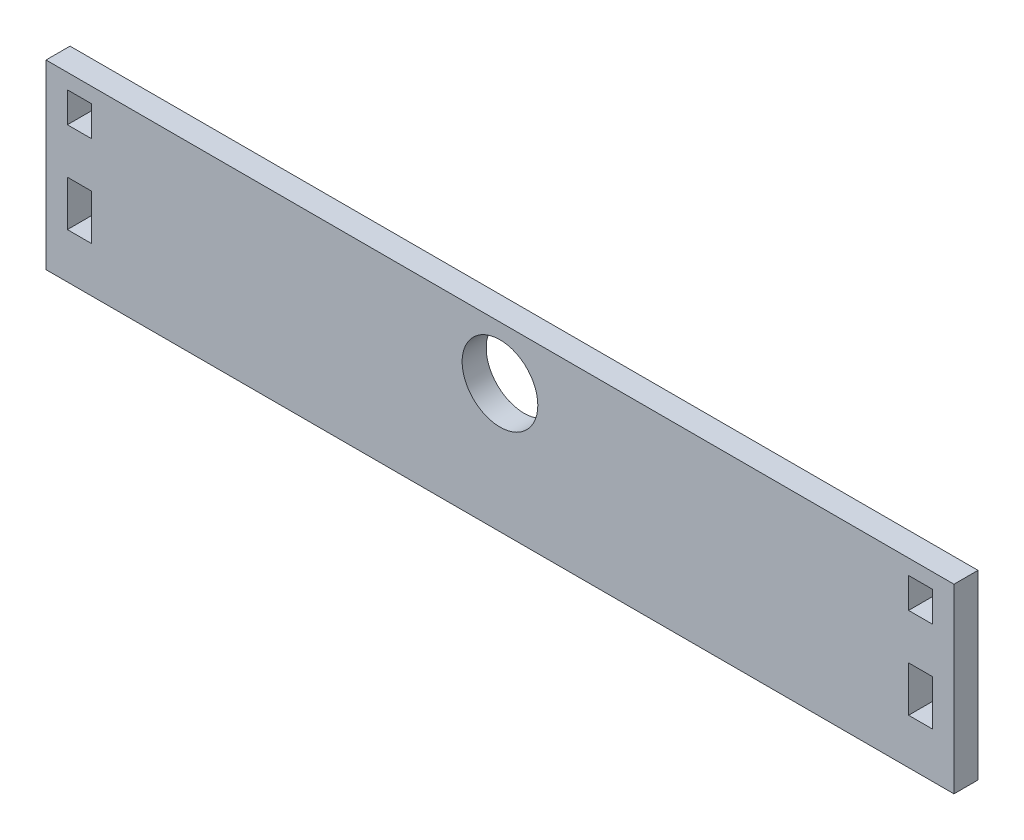
ISO-10303-21;
HEADER;
FILE_DESCRIPTION(('STEP AP214'),'2;1');
FILE_NAME('part.step','',(''),(''),'','','');
FILE_SCHEMA(('AUTOMOTIVE_DESIGN { 1 0 10303 214 1 1 1 1 }'));
ENDSEC;
DATA;
#1=APPLICATION_CONTEXT('core data for automotive mechanical design processes');
#2=APPLICATION_PROTOCOL_DEFINITION('international standard','automotive_design',2000,#1);
#3=PRODUCT_CONTEXT('',#1,'mechanical');
#4=PRODUCT('Part','Part','',(#3));
#5=PRODUCT_RELATED_PRODUCT_CATEGORY('part','',(#4));
#6=PRODUCT_DEFINITION_FORMATION('','',#4);
#7=PRODUCT_DEFINITION_CONTEXT('part definition',#1,'design');
#8=PRODUCT_DEFINITION('design','',#6,#7);
#9=PRODUCT_DEFINITION_SHAPE('','',#8);
#10=(LENGTH_UNIT() NAMED_UNIT(*) SI_UNIT(.MILLI.,.METRE.));
#11=(NAMED_UNIT(*) PLANE_ANGLE_UNIT() SI_UNIT($,.RADIAN.));
#12=(NAMED_UNIT(*) SI_UNIT($,.STERADIAN.) SOLID_ANGLE_UNIT());
#13=UNCERTAINTY_MEASURE_WITH_UNIT(LENGTH_MEASURE(1.E-05),#10,'distance_accuracy_value','');
#14=(GEOMETRIC_REPRESENTATION_CONTEXT(3) GLOBAL_UNCERTAINTY_ASSIGNED_CONTEXT((#13)) GLOBAL_UNIT_ASSIGNED_CONTEXT((#10,
#11,#12)) REPRESENTATION_CONTEXT('',''));
#15=CARTESIAN_POINT('',(0.,0.,0.));
#16=DIRECTION('',(0.,0.,1.));
#17=DIRECTION('',(1.,0.,0.));
#18=AXIS2_PLACEMENT_3D('',#15,#16,#17);
#19=CARTESIAN_POINT('',(0.,2.00000000000002,1.5875));
#20=DIRECTION('',(0.,-1.,0.));
#21=DIRECTION('',(1.,0.,0.));
#22=AXIS2_PLACEMENT_3D('',#19,#20,#21);
#23=PLANE('',#22);
#24=DIRECTION('',(-1.,0.,0.));
#25=VECTOR('',#24,1.);
#26=CARTESIAN_POINT('',(0.,2.00000000000002,0.));
#27=LINE('',#26,#25);
#28=CARTESIAN_POINT('',(55.5875,1.99999999999999,0.));
#29=VERTEX_POINT('',#28);
#30=CARTESIAN_POINT('',(54.,2.,0.));
#31=VERTEX_POINT('',#30);
#32=EDGE_CURVE('E252',#29,#31,#27,.T.);
#33=ORIENTED_EDGE('',*,*,#32,.T.);
#34=DIRECTION('',(0.,0.,-1.));
#35=VECTOR('',#34,1.);
#36=CARTESIAN_POINT('',(54.,2.,1.5875));
#37=LINE('',#36,#35);
#38=CARTESIAN_POINT('',(54.,2.,1.5875));
#39=VERTEX_POINT('',#38);
#40=EDGE_CURVE('E11',#39,#31,#37,.T.);
#41=ORIENTED_EDGE('',*,*,#40,.F.);
#42=DIRECTION('',(-1.,0.,0.));
#43=VECTOR('',#42,1.);
#44=CARTESIAN_POINT('',(0.,2.00000000000002,1.5875));
#45=LINE('',#44,#43);
#46=CARTESIAN_POINT('',(55.5875,1.99999999999999,1.5875));
#47=VERTEX_POINT('',#46);
#48=EDGE_CURVE('E192',#47,#39,#45,.T.);
#49=ORIENTED_EDGE('',*,*,#48,.F.);
#50=DIRECTION('',(0.,0.,-1.));
#51=VECTOR('',#50,1.);
#52=CARTESIAN_POINT('',(55.5875,1.99999999999999,1.5875));
#53=LINE('',#52,#51);
#54=EDGE_CURVE('E259',#47,#29,#53,.T.);
#55=ORIENTED_EDGE('',*,*,#54,.T.);
#56=EDGE_LOOP('',(#33,#41,#49,#55));
#57=FACE_BOUND('',#56,.T.);
#58=ADVANCED_FACE('F39',(#57),#23,.F.);
#59=CARTESIAN_POINT('',(54.,0.,1.5875));
#60=DIRECTION('',(-1.,0.,0.));
#61=DIRECTION('',(0.,0.,1.));
#62=AXIS2_PLACEMENT_3D('',#59,#60,#61);
#63=PLANE('',#62);
#64=DIRECTION('',(0.,1.,0.));
#65=VECTOR('',#64,1.);
#66=CARTESIAN_POINT('',(54.,0.,0.));
#67=LINE('',#66,#65);
#68=CARTESIAN_POINT('',(54.,5.,0.));
#69=VERTEX_POINT('',#68);
#70=EDGE_CURVE('E197',#31,#69,#67,.T.);
#71=ORIENTED_EDGE('',*,*,#70,.T.);
#72=DIRECTION('',(0.,0.,-1.));
#73=VECTOR('',#72,1.);
#74=CARTESIAN_POINT('',(54.,5.,1.5875));
#75=LINE('',#74,#73);
#76=CARTESIAN_POINT('',(54.,5.,1.5875));
#77=VERTEX_POINT('',#76);
#78=EDGE_CURVE('E49',#77,#69,#75,.T.);
#79=ORIENTED_EDGE('',*,*,#78,.F.);
#80=DIRECTION('',(0.,1.,0.));
#81=VECTOR('',#80,1.);
#82=CARTESIAN_POINT('',(54.,0.,1.5875));
#83=LINE('',#82,#81);
#84=EDGE_CURVE('E186',#39,#77,#83,.T.);
#85=ORIENTED_EDGE('',*,*,#84,.F.);
#86=ORIENTED_EDGE('',*,*,#40,.T.);
#87=EDGE_LOOP('',(#71,#79,#85,#86));
#88=FACE_BOUND('',#87,.T.);
#89=ADVANCED_FACE('F196',(#88),#63,.F.);
#90=CARTESIAN_POINT('',(0.,5.00000000000002,1.5875));
#91=DIRECTION('',(0.,1.,0.));
#92=DIRECTION('',(-1.,0.,0.));
#93=AXIS2_PLACEMENT_3D('',#90,#91,#92);
#94=PLANE('',#93);
#95=DIRECTION('',(1.,0.,0.));
#96=VECTOR('',#95,1.);
#97=CARTESIAN_POINT('',(0.,5.00000000000002,0.));
#98=LINE('',#97,#96);
#99=CARTESIAN_POINT('',(55.5875,4.99999999999999,0.));
#100=VERTEX_POINT('',#99);
#101=EDGE_CURVE('E123',#69,#100,#98,.T.);
#102=ORIENTED_EDGE('',*,*,#101,.T.);
#103=DIRECTION('',(0.,0.,-1.));
#104=VECTOR('',#103,1.);
#105=CARTESIAN_POINT('',(55.5875,4.99999999999999,1.5875));
#106=LINE('',#105,#104);
#107=CARTESIAN_POINT('',(55.5875,4.99999999999999,1.5875));
#108=VERTEX_POINT('',#107);
#109=EDGE_CURVE('E198',#108,#100,#106,.T.);
#110=ORIENTED_EDGE('',*,*,#109,.F.);
#111=DIRECTION('',(1.,0.,0.));
#112=VECTOR('',#111,1.);
#113=CARTESIAN_POINT('',(0.,5.00000000000002,1.5875));
#114=LINE('',#113,#112);
#115=EDGE_CURVE('E190',#77,#108,#114,.T.);
#116=ORIENTED_EDGE('',*,*,#115,.F.);
#117=ORIENTED_EDGE('',*,*,#78,.T.);
#118=EDGE_LOOP('',(#102,#110,#116,#117));
#119=FACE_BOUND('',#118,.T.);
#120=ADVANCED_FACE('F200',(#119),#94,.F.);
#121=CARTESIAN_POINT('',(0.,8.00000000000012,1.5875));
#122=DIRECTION('',(0.,-1.,0.));
#123=DIRECTION('',(1.,0.,0.));
#124=AXIS2_PLACEMENT_3D('',#121,#122,#123);
#125=PLANE('',#124);
#126=DIRECTION('',(-1.,0.,0.));
#127=VECTOR('',#126,1.);
#128=CARTESIAN_POINT('',(0.,8.00000000000012,0.));
#129=LINE('',#128,#127);
#130=CARTESIAN_POINT('',(55.5875,8.,0.));
#131=VERTEX_POINT('',#130);
#132=CARTESIAN_POINT('',(54.,8.,0.));
#133=VERTEX_POINT('',#132);
#134=EDGE_CURVE('E243',#131,#133,#129,.T.);
#135=ORIENTED_EDGE('',*,*,#134,.T.);
#136=DIRECTION('',(0.,0.,-1.));
#137=VECTOR('',#136,1.);
#138=CARTESIAN_POINT('',(54.,8.,1.5875));
#139=LINE('',#138,#137);
#140=CARTESIAN_POINT('',(54.,8.,1.5875));
#141=VERTEX_POINT('',#140);
#142=EDGE_CURVE('E261',#141,#133,#139,.T.);
#143=ORIENTED_EDGE('',*,*,#142,.F.);
#144=DIRECTION('',(-1.,0.,0.));
#145=VECTOR('',#144,1.);
#146=CARTESIAN_POINT('',(0.,8.00000000000012,1.5875));
#147=LINE('',#146,#145);
#148=CARTESIAN_POINT('',(55.5875,8.,1.5875));
#149=VERTEX_POINT('',#148);
#150=EDGE_CURVE('E344',#149,#141,#147,.T.);
#151=ORIENTED_EDGE('',*,*,#150,.F.);
#152=DIRECTION('',(0.,0.,-1.));
#153=VECTOR('',#152,1.);
#154=CARTESIAN_POINT('',(55.5875,8.,1.5875));
#155=LINE('',#154,#153);
#156=EDGE_CURVE('E263',#149,#131,#155,.T.);
#157=ORIENTED_EDGE('',*,*,#156,.T.);
#158=EDGE_LOOP('',(#135,#143,#151,#157));
#159=FACE_BOUND('',#158,.T.);
#160=ADVANCED_FACE('F364',(#159),#125,.F.);
#161=CARTESIAN_POINT('',(54.,0.,1.5875));
#162=DIRECTION('',(-1.,0.,0.));
#163=DIRECTION('',(0.,0.,1.));
#164=AXIS2_PLACEMENT_3D('',#161,#162,#163);
#165=PLANE('',#164);
#166=DIRECTION('',(0.,1.,0.));
#167=VECTOR('',#166,1.);
#168=CARTESIAN_POINT('',(54.,0.,0.));
#169=LINE('',#168,#167);
#170=CARTESIAN_POINT('',(54.,10.,0.));
#171=VERTEX_POINT('',#170);
#172=EDGE_CURVE('E246',#133,#171,#169,.T.);
#173=ORIENTED_EDGE('',*,*,#172,.T.);
#174=DIRECTION('',(0.,0.,-1.));
#175=VECTOR('',#174,1.);
#176=CARTESIAN_POINT('',(54.,10.,1.5875));
#177=LINE('',#176,#175);
#178=CARTESIAN_POINT('',(54.,10.,1.5875));
#179=VERTEX_POINT('',#178);
#180=EDGE_CURVE('E270',#179,#171,#177,.T.);
#181=ORIENTED_EDGE('',*,*,#180,.F.);
#182=DIRECTION('',(0.,1.,0.));
#183=VECTOR('',#182,1.);
#184=CARTESIAN_POINT('',(54.,0.,1.5875));
#185=LINE('',#184,#183);
#186=EDGE_CURVE('E347',#141,#179,#185,.T.);
#187=ORIENTED_EDGE('',*,*,#186,.F.);
#188=ORIENTED_EDGE('',*,*,#142,.T.);
#189=EDGE_LOOP('',(#173,#181,#187,#188));
#190=FACE_BOUND('',#189,.T.);
#191=ADVANCED_FACE('F366',(#190),#165,.F.);
#192=CARTESIAN_POINT('',(0.,10.0000000000002,1.5875));
#193=DIRECTION('',(0.,1.,0.));
#194=DIRECTION('',(-1.,0.,0.));
#195=AXIS2_PLACEMENT_3D('',#192,#193,#194);
#196=PLANE('',#195);
#197=DIRECTION('',(1.,0.,0.));
#198=VECTOR('',#197,1.);
#199=CARTESIAN_POINT('',(0.,10.0000000000002,0.));
#200=LINE('',#199,#198);
#201=CARTESIAN_POINT('',(55.5875,9.99999999999999,0.));
#202=VERTEX_POINT('',#201);
#203=EDGE_CURVE('E248',#171,#202,#200,.T.);
#204=ORIENTED_EDGE('',*,*,#203,.T.);
#205=DIRECTION('',(0.,0.,-1.));
#206=VECTOR('',#205,1.);
#207=CARTESIAN_POINT('',(55.5875,9.99999999999999,1.5875));
#208=LINE('',#207,#206);
#209=CARTESIAN_POINT('',(55.5875,9.99999999999999,1.5875));
#210=VERTEX_POINT('',#209);
#211=EDGE_CURVE('E266',#210,#202,#208,.T.);
#212=ORIENTED_EDGE('',*,*,#211,.F.);
#213=DIRECTION('',(1.,0.,0.));
#214=VECTOR('',#213,1.);
#215=CARTESIAN_POINT('',(0.,10.0000000000002,1.5875));
#216=LINE('',#215,#214);
#217=EDGE_CURVE('E349',#179,#210,#216,.T.);
#218=ORIENTED_EDGE('',*,*,#217,.F.);
#219=ORIENTED_EDGE('',*,*,#180,.T.);
#220=EDGE_LOOP('',(#204,#212,#218,#219));
#221=FACE_BOUND('',#220,.T.);
#222=ADVANCED_FACE('F370',(#221),#196,.F.);
#223=CARTESIAN_POINT('',(57.,0.,1.5875));
#224=DIRECTION('',(1.,0.,0.));
#225=DIRECTION('',(0.,0.,-1.));
#226=AXIS2_PLACEMENT_3D('',#223,#224,#225);
#227=PLANE('',#226);
#228=DIRECTION('',(0.,-1.,0.));
#229=VECTOR('',#228,1.);
#230=CARTESIAN_POINT('',(57.,0.,0.));
#231=LINE('',#230,#229);
#232=CARTESIAN_POINT('',(57.,11.,0.));
#233=VERTEX_POINT('',#232);
#234=CARTESIAN_POINT('',(57.,-1.00000000000001,0.));
#235=VERTEX_POINT('',#234);
#236=EDGE_CURVE('E231',#233,#235,#231,.T.);
#237=ORIENTED_EDGE('',*,*,#236,.F.);
#238=DIRECTION('',(0.,0.,-1.));
#239=VECTOR('',#238,1.);
#240=CARTESIAN_POINT('',(57.,11.,1.5875));
#241=LINE('',#240,#239);
#242=CARTESIAN_POINT('',(57.,11.,1.5875));
#243=VERTEX_POINT('',#242);
#244=EDGE_CURVE('E267',#243,#233,#241,.T.);
#245=ORIENTED_EDGE('',*,*,#244,.F.);
#246=DIRECTION('',(0.,-1.,0.));
#247=VECTOR('',#246,1.);
#248=CARTESIAN_POINT('',(57.,0.,1.5875));
#249=LINE('',#248,#247);
#250=CARTESIAN_POINT('',(57.,-1.00000000000001,1.5875));
#251=VERTEX_POINT('',#250);
#252=EDGE_CURVE('E332',#243,#251,#249,.T.);
#253=ORIENTED_EDGE('',*,*,#252,.T.);
#254=DIRECTION('',(0.,0.,-1.));
#255=VECTOR('',#254,1.);
#256=CARTESIAN_POINT('',(57.,-1.00000000000001,1.5875));
#257=LINE('',#256,#255);
#258=EDGE_CURVE('E275',#251,#235,#257,.T.);
#259=ORIENTED_EDGE('',*,*,#258,.T.);
#260=EDGE_LOOP('',(#237,#245,#253,#259));
#261=FACE_BOUND('',#260,.T.);
#262=ADVANCED_FACE('F403',(#261),#227,.T.);
#263=CARTESIAN_POINT('',(0.,11.,1.5875));
#264=DIRECTION('',(0.,1.,0.));
#265=DIRECTION('',(0.,0.,1.));
#266=AXIS2_PLACEMENT_3D('',#263,#264,#265);
#267=PLANE('',#266);
#268=DIRECTION('',(1.,0.,0.));
#269=VECTOR('',#268,1.);
#270=CARTESIAN_POINT('',(0.,11.,0.));
#271=LINE('',#270,#269);
#272=CARTESIAN_POINT('',(-3.,11.,0.));
#273=VERTEX_POINT('',#272);
#274=EDGE_CURVE('E234',#273,#233,#271,.T.);
#275=ORIENTED_EDGE('',*,*,#274,.F.);
#276=DIRECTION('',(0.,0.,-1.));
#277=VECTOR('',#276,1.);
#278=CARTESIAN_POINT('',(-3.,11.,1.5875));
#279=LINE('',#278,#277);
#280=CARTESIAN_POINT('',(-3.,11.,1.5875));
#281=VERTEX_POINT('',#280);
#282=EDGE_CURVE('E280',#281,#273,#279,.T.);
#283=ORIENTED_EDGE('',*,*,#282,.F.);
#284=DIRECTION('',(1.,0.,0.));
#285=VECTOR('',#284,1.);
#286=CARTESIAN_POINT('',(0.,11.,1.5875));
#287=LINE('',#286,#285);
#288=EDGE_CURVE('E335',#281,#243,#287,.T.);
#289=ORIENTED_EDGE('',*,*,#288,.T.);
#290=ORIENTED_EDGE('',*,*,#244,.T.);
#291=EDGE_LOOP('',(#275,#283,#289,#290));
#292=FACE_BOUND('',#291,.T.);
#293=ADVANCED_FACE('F415',(#292),#267,.T.);
#294=CARTESIAN_POINT('',(-3.,0.,1.5875));
#295=DIRECTION('',(-1.,0.,0.));
#296=DIRECTION('',(0.,0.,1.));
#297=AXIS2_PLACEMENT_3D('',#294,#295,#296);
#298=PLANE('',#297);
#299=DIRECTION('',(0.,1.,0.));
#300=VECTOR('',#299,1.);
#301=CARTESIAN_POINT('',(-3.,0.,0.));
#302=LINE('',#301,#300);
#303=CARTESIAN_POINT('',(-3.,-1.00000000000001,0.));
#304=VERTEX_POINT('',#303);
#305=EDGE_CURVE('E237',#304,#273,#302,.T.);
#306=ORIENTED_EDGE('',*,*,#305,.F.);
#307=DIRECTION('',(0.,0.,-1.));
#308=VECTOR('',#307,1.);
#309=CARTESIAN_POINT('',(-3.,-1.00000000000001,1.5875));
#310=LINE('',#309,#308);
#311=CARTESIAN_POINT('',(-3.,-1.00000000000001,1.5875));
#312=VERTEX_POINT('',#311);
#313=EDGE_CURVE('E277',#312,#304,#310,.T.);
#314=ORIENTED_EDGE('',*,*,#313,.F.);
#315=DIRECTION('',(0.,1.,0.));
#316=VECTOR('',#315,1.);
#317=CARTESIAN_POINT('',(-3.,0.,1.5875));
#318=LINE('',#317,#316);
#319=EDGE_CURVE('E338',#312,#281,#318,.T.);
#320=ORIENTED_EDGE('',*,*,#319,.T.);
#321=ORIENTED_EDGE('',*,*,#282,.T.);
#322=EDGE_LOOP('',(#306,#314,#320,#321));
#323=FACE_BOUND('',#322,.T.);
#324=ADVANCED_FACE('F411',(#323),#298,.T.);
#325=CARTESIAN_POINT('',(0.,0.,1.5875));
#326=DIRECTION('',(-1.,0.,0.));
#327=DIRECTION('',(0.,0.,1.));
#328=AXIS2_PLACEMENT_3D('',#325,#326,#327);
#329=PLANE('',#328);
#330=DIRECTION('',(0.,1.,0.));
#331=VECTOR('',#330,1.);
#332=CARTESIAN_POINT('',(0.,0.,0.));
#333=LINE('',#332,#331);
#334=CARTESIAN_POINT('',(0.,8.,0.));
#335=VERTEX_POINT('',#334);
#336=CARTESIAN_POINT('',(0.,10.,0.));
#337=VERTEX_POINT('',#336);
#338=EDGE_CURVE('E219',#335,#337,#333,.T.);
#339=ORIENTED_EDGE('',*,*,#338,.F.);
#340=DIRECTION('',(0.,0.,-1.));
#341=VECTOR('',#340,1.);
#342=CARTESIAN_POINT('',(0.,8.,1.5875));
#343=LINE('',#342,#341);
#344=CARTESIAN_POINT('',(0.,8.,1.5875));
#345=VERTEX_POINT('',#344);
#346=EDGE_CURVE('E278',#345,#335,#343,.T.);
#347=ORIENTED_EDGE('',*,*,#346,.F.);
#348=DIRECTION('',(0.,1.,0.));
#349=VECTOR('',#348,1.);
#350=CARTESIAN_POINT('',(0.,0.,1.5875));
#351=LINE('',#350,#349);
#352=CARTESIAN_POINT('',(0.,10.,1.5875));
#353=VERTEX_POINT('',#352);
#354=EDGE_CURVE('E317',#345,#353,#351,.T.);
#355=ORIENTED_EDGE('',*,*,#354,.T.);
#356=DIRECTION('',(0.,0.,-1.));
#357=VECTOR('',#356,1.);
#358=CARTESIAN_POINT('',(0.,10.,1.5875));
#359=LINE('',#358,#357);
#360=EDGE_CURVE('E283',#353,#337,#359,.T.);
#361=ORIENTED_EDGE('',*,*,#360,.T.);
#362=EDGE_LOOP('',(#339,#347,#355,#361));
#363=FACE_BOUND('',#362,.T.);
#364=ADVANCED_FACE('F414',(#363),#329,.T.);
#365=CARTESIAN_POINT('',(0.,8.,1.5875));
#366=DIRECTION('',(0.,1.,0.));
#367=DIRECTION('',(-1.,0.,0.));
#368=AXIS2_PLACEMENT_3D('',#365,#366,#367);
#369=PLANE('',#368);
#370=DIRECTION('',(1.,0.,0.));
#371=VECTOR('',#370,1.);
#372=CARTESIAN_POINT('',(0.,8.,0.));
#373=LINE('',#372,#371);
#374=CARTESIAN_POINT('',(-1.5875,8.,0.));
#375=VERTEX_POINT('',#374);
#376=EDGE_CURVE('E222',#375,#335,#373,.T.);
#377=ORIENTED_EDGE('',*,*,#376,.F.);
#378=DIRECTION('',(0.,0.,-1.));
#379=VECTOR('',#378,1.);
#380=CARTESIAN_POINT('',(-1.5875,8.,1.5875));
#381=LINE('',#380,#379);
#382=CARTESIAN_POINT('',(-1.5875,8.,1.5875));
#383=VERTEX_POINT('',#382);
#384=EDGE_CURVE('E287',#383,#375,#381,.T.);
#385=ORIENTED_EDGE('',*,*,#384,.F.);
#386=DIRECTION('',(1.,0.,0.));
#387=VECTOR('',#386,1.);
#388=CARTESIAN_POINT('',(0.,8.,1.5875));
#389=LINE('',#388,#387);
#390=EDGE_CURVE('E320',#383,#345,#389,.T.);
#391=ORIENTED_EDGE('',*,*,#390,.T.);
#392=ORIENTED_EDGE('',*,*,#346,.T.);
#393=EDGE_LOOP('',(#377,#385,#391,#392));
#394=FACE_BOUND('',#393,.T.);
#395=ADVANCED_FACE('F429',(#394),#369,.T.);
#396=CARTESIAN_POINT('',(-1.5875,0.,1.5875));
#397=DIRECTION('',(1.,0.,0.));
#398=DIRECTION('',(0.,1.,0.));
#399=AXIS2_PLACEMENT_3D('',#396,#397,#398);
#400=PLANE('',#399);
#401=DIRECTION('',(0.,-1.,0.));
#402=VECTOR('',#401,1.);
#403=CARTESIAN_POINT('',(-1.5875,0.,0.));
#404=LINE('',#403,#402);
#405=CARTESIAN_POINT('',(-1.5875,9.99999999999999,0.));
#406=VERTEX_POINT('',#405);
#407=EDGE_CURVE('E225',#406,#375,#404,.T.);
#408=ORIENTED_EDGE('',*,*,#407,.F.);
#409=DIRECTION('',(0.,0.,-1.));
#410=VECTOR('',#409,1.);
#411=CARTESIAN_POINT('',(-1.5875,9.99999999999999,1.5875));
#412=LINE('',#411,#410);
#413=CARTESIAN_POINT('',(-1.5875,9.99999999999999,1.5875));
#414=VERTEX_POINT('',#413);
#415=EDGE_CURVE('E285',#414,#406,#412,.T.);
#416=ORIENTED_EDGE('',*,*,#415,.F.);
#417=DIRECTION('',(0.,-1.,0.));
#418=VECTOR('',#417,1.);
#419=CARTESIAN_POINT('',(-1.5875,0.,1.5875));
#420=LINE('',#419,#418);
#421=EDGE_CURVE('E326',#414,#383,#420,.T.);
#422=ORIENTED_EDGE('',*,*,#421,.T.);
#423=ORIENTED_EDGE('',*,*,#384,.T.);
#424=EDGE_LOOP('',(#408,#416,#422,#423));
#425=FACE_BOUND('',#424,.T.);
#426=ADVANCED_FACE('F426',(#425),#400,.T.);
#427=CARTESIAN_POINT('',(0.,0.,1.5875));
#428=DIRECTION('',(-1.,0.,0.));
#429=DIRECTION('',(0.,-1.,0.));
#430=AXIS2_PLACEMENT_3D('',#427,#428,#429);
#431=PLANE('',#430);
#432=DIRECTION('',(0.,1.,0.));
#433=VECTOR('',#432,1.);
#434=CARTESIAN_POINT('',(0.,0.,0.));
#435=LINE('',#434,#433);
#436=CARTESIAN_POINT('',(0.,2.,0.));
#437=VERTEX_POINT('',#436);
#438=CARTESIAN_POINT('',(0.,5.,0.));
#439=VERTEX_POINT('',#438);
#440=EDGE_CURVE('E206',#437,#439,#435,.T.);
#441=ORIENTED_EDGE('',*,*,#440,.F.);
#442=DIRECTION('',(0.,0.,-1.));
#443=VECTOR('',#442,1.);
#444=CARTESIAN_POINT('',(0.,2.,1.5875));
#445=LINE('',#444,#443);
#446=CARTESIAN_POINT('',(0.,2.,1.5875));
#447=VERTEX_POINT('',#446);
#448=EDGE_CURVE('E43',#447,#437,#445,.T.);
#449=ORIENTED_EDGE('',*,*,#448,.F.);
#450=DIRECTION('',(0.,1.,0.));
#451=VECTOR('',#450,1.);
#452=CARTESIAN_POINT('',(0.,0.,1.5875));
#453=LINE('',#452,#451);
#454=CARTESIAN_POINT('',(0.,5.,1.5875));
#455=VERTEX_POINT('',#454);
#456=EDGE_CURVE('E258',#447,#455,#453,.T.);
#457=ORIENTED_EDGE('',*,*,#456,.T.);
#458=DIRECTION('',(0.,0.,-1.));
#459=VECTOR('',#458,1.);
#460=CARTESIAN_POINT('',(0.,5.,1.5875));
#461=LINE('',#460,#459);
#462=EDGE_CURVE('E202',#455,#439,#461,.T.);
#463=ORIENTED_EDGE('',*,*,#462,.T.);
#464=EDGE_LOOP('',(#441,#449,#457,#463));
#465=FACE_BOUND('',#464,.T.);
#466=ADVANCED_FACE('F41',(#465),#431,.T.);
#467=CARTESIAN_POINT('',(0.,2.,1.5875));
#468=DIRECTION('',(0.,1.,0.));
#469=DIRECTION('',(-1.,0.,0.));
#470=AXIS2_PLACEMENT_3D('',#467,#468,#469);
#471=PLANE('',#470);
#472=DIRECTION('',(1.,0.,0.));
#473=VECTOR('',#472,1.);
#474=CARTESIAN_POINT('',(0.,2.,0.));
#475=LINE('',#474,#473);
#476=CARTESIAN_POINT('',(-1.5875,1.99999999999999,0.));
#477=VERTEX_POINT('',#476);
#478=EDGE_CURVE('E209',#477,#437,#475,.T.);
#479=ORIENTED_EDGE('',*,*,#478,.F.);
#480=DIRECTION('',(0.,0.,-1.));
#481=VECTOR('',#480,1.);
#482=CARTESIAN_POINT('',(-1.5875,1.99999999999999,1.5875));
#483=LINE('',#482,#481);
#484=CARTESIAN_POINT('',(-1.5875,1.99999999999999,1.5875));
#485=VERTEX_POINT('',#484);
#486=EDGE_CURVE('E292',#485,#477,#483,.T.);
#487=ORIENTED_EDGE('',*,*,#486,.F.);
#488=DIRECTION('',(1.,0.,0.));
#489=VECTOR('',#488,1.);
#490=CARTESIAN_POINT('',(0.,2.,1.5875));
#491=LINE('',#490,#489);
#492=EDGE_CURVE('E301',#485,#447,#491,.T.);
#493=ORIENTED_EDGE('',*,*,#492,.T.);
#494=ORIENTED_EDGE('',*,*,#448,.T.);
#495=EDGE_LOOP('',(#479,#487,#493,#494));
#496=FACE_BOUND('',#495,.T.);
#497=ADVANCED_FACE('F299',(#496),#471,.T.);
#498=CARTESIAN_POINT('',(-1.5875,0.,1.5875));
#499=DIRECTION('',(1.,0.,0.));
#500=DIRECTION('',(0.,1.,0.));
#501=AXIS2_PLACEMENT_3D('',#498,#499,#500);
#502=PLANE('',#501);
#503=DIRECTION('',(0.,-1.,0.));
#504=VECTOR('',#503,1.);
#505=CARTESIAN_POINT('',(-1.5875,0.,0.));
#506=LINE('',#505,#504);
#507=CARTESIAN_POINT('',(-1.5875,4.99999999999999,0.));
#508=VERTEX_POINT('',#507);
#509=EDGE_CURVE('E213',#508,#477,#506,.T.);
#510=ORIENTED_EDGE('',*,*,#509,.F.);
#511=DIRECTION('',(0.,0.,-1.));
#512=VECTOR('',#511,1.);
#513=CARTESIAN_POINT('',(-1.5875,4.99999999999999,1.5875));
#514=LINE('',#513,#512);
#515=CARTESIAN_POINT('',(-1.5875,4.99999999999999,1.5875));
#516=VERTEX_POINT('',#515);
#517=EDGE_CURVE('E291',#516,#508,#514,.T.);
#518=ORIENTED_EDGE('',*,*,#517,.F.);
#519=DIRECTION('',(0.,-1.,0.));
#520=VECTOR('',#519,1.);
#521=CARTESIAN_POINT('',(-1.5875,0.,1.5875));
#522=LINE('',#521,#520);
#523=EDGE_CURVE('E308',#516,#485,#522,.T.);
#524=ORIENTED_EDGE('',*,*,#523,.T.);
#525=ORIENTED_EDGE('',*,*,#486,.T.);
#526=EDGE_LOOP('',(#510,#518,#524,#525));
#527=FACE_BOUND('',#526,.T.);
#528=ADVANCED_FACE('F306',(#527),#502,.T.);
#529=CARTESIAN_POINT('',(55.5875,0.,1.5875));
#530=DIRECTION('',(1.,0.,0.));
#531=DIRECTION('',(0.,0.,-1.));
#532=AXIS2_PLACEMENT_3D('',#529,#530,#531);
#533=PLANE('',#532);
#534=DIRECTION('',(0.,-1.,0.));
#535=VECTOR('',#534,1.);
#536=CARTESIAN_POINT('',(55.5875,0.,0.));
#537=LINE('',#536,#535);
#538=EDGE_CURVE('E250',#202,#131,#537,.T.);
#539=ORIENTED_EDGE('',*,*,#538,.T.);
#540=ORIENTED_EDGE('',*,*,#156,.F.);
#541=DIRECTION('',(0.,-1.,0.));
#542=VECTOR('',#541,1.);
#543=CARTESIAN_POINT('',(55.5875,0.,1.5875));
#544=LINE('',#543,#542);
#545=EDGE_CURVE('E351',#210,#149,#544,.T.);
#546=ORIENTED_EDGE('',*,*,#545,.F.);
#547=ORIENTED_EDGE('',*,*,#211,.T.);
#548=EDGE_LOOP('',(#539,#540,#546,#547));
#549=FACE_BOUND('',#548,.T.);
#550=ADVANCED_FACE('F360',(#549),#533,.F.);
#551=CARTESIAN_POINT('',(0.,-1.00000000000001,1.5875));
#552=DIRECTION('',(0.,-1.,0.));
#553=DIRECTION('',(0.,0.,-1.));
#554=AXIS2_PLACEMENT_3D('',#551,#552,#553);
#555=PLANE('',#554);
#556=DIRECTION('',(-1.,0.,0.));
#557=VECTOR('',#556,1.);
#558=CARTESIAN_POINT('',(0.,-1.00000000000001,0.));
#559=LINE('',#558,#557);
#560=EDGE_CURVE('E240',#235,#304,#559,.T.);
#561=ORIENTED_EDGE('',*,*,#560,.F.);
#562=ORIENTED_EDGE('',*,*,#258,.F.);
#563=DIRECTION('',(-1.,0.,0.));
#564=VECTOR('',#563,1.);
#565=CARTESIAN_POINT('',(0.,-1.00000000000001,1.5875));
#566=LINE('',#565,#564);
#567=EDGE_CURVE('E341',#251,#312,#566,.T.);
#568=ORIENTED_EDGE('',*,*,#567,.T.);
#569=ORIENTED_EDGE('',*,*,#313,.T.);
#570=EDGE_LOOP('',(#561,#562,#568,#569));
#571=FACE_BOUND('',#570,.T.);
#572=ADVANCED_FACE('F400',(#571),#555,.T.);
#573=CARTESIAN_POINT('',(0.,10.,1.5875));
#574=DIRECTION('',(0.,-1.,0.));
#575=DIRECTION('',(1.,0.,0.));
#576=AXIS2_PLACEMENT_3D('',#573,#574,#575);
#577=PLANE('',#576);
#578=DIRECTION('',(-1.,0.,0.));
#579=VECTOR('',#578,1.);
#580=CARTESIAN_POINT('',(0.,10.,0.));
#581=LINE('',#580,#579);
#582=EDGE_CURVE('E228',#337,#406,#581,.T.);
#583=ORIENTED_EDGE('',*,*,#582,.F.);
#584=ORIENTED_EDGE('',*,*,#360,.F.);
#585=DIRECTION('',(-1.,0.,0.));
#586=VECTOR('',#585,1.);
#587=CARTESIAN_POINT('',(0.,10.,1.5875));
#588=LINE('',#587,#586);
#589=EDGE_CURVE('E329',#353,#414,#588,.T.);
#590=ORIENTED_EDGE('',*,*,#589,.T.);
#591=ORIENTED_EDGE('',*,*,#415,.T.);
#592=EDGE_LOOP('',(#583,#584,#590,#591));
#593=FACE_BOUND('',#592,.T.);
#594=ADVANCED_FACE('F388',(#593),#577,.T.);
#595=CARTESIAN_POINT('',(0.,5.,1.5875));
#596=DIRECTION('',(0.,-1.,0.));
#597=DIRECTION('',(1.,0.,0.));
#598=AXIS2_PLACEMENT_3D('',#595,#596,#597);
#599=PLANE('',#598);
#600=DIRECTION('',(-1.,0.,0.));
#601=VECTOR('',#600,1.);
#602=CARTESIAN_POINT('',(0.,5.,0.));
#603=LINE('',#602,#601);
#604=EDGE_CURVE('E216',#439,#508,#603,.T.);
#605=ORIENTED_EDGE('',*,*,#604,.F.);
#606=ORIENTED_EDGE('',*,*,#462,.F.);
#607=DIRECTION('',(-1.,0.,0.));
#608=VECTOR('',#607,1.);
#609=CARTESIAN_POINT('',(0.,5.,1.5875));
#610=LINE('',#609,#608);
#611=EDGE_CURVE('E314',#455,#516,#610,.T.);
#612=ORIENTED_EDGE('',*,*,#611,.T.);
#613=ORIENTED_EDGE('',*,*,#517,.T.);
#614=EDGE_LOOP('',(#605,#606,#612,#613));
#615=FACE_BOUND('',#614,.T.);
#616=ADVANCED_FACE('F316',(#615),#599,.T.);
#617=CARTESIAN_POINT('',(55.5875,0.,1.5875));
#618=DIRECTION('',(1.,0.,0.));
#619=DIRECTION('',(0.,0.,-1.));
#620=AXIS2_PLACEMENT_3D('',#617,#618,#619);
#621=PLANE('',#620);
#622=DIRECTION('',(0.,-1.,0.));
#623=VECTOR('',#622,1.);
#624=CARTESIAN_POINT('',(55.5875,0.,0.));
#625=LINE('',#624,#623);
#626=EDGE_CURVE('E129',#100,#29,#625,.T.);
#627=ORIENTED_EDGE('',*,*,#626,.T.);
#628=ORIENTED_EDGE('',*,*,#54,.F.);
#629=DIRECTION('',(0.,-1.,0.));
#630=VECTOR('',#629,1.);
#631=CARTESIAN_POINT('',(55.5875,0.,1.5875));
#632=LINE('',#631,#630);
#633=EDGE_CURVE('E58',#108,#47,#632,.T.);
#634=ORIENTED_EDGE('',*,*,#633,.F.);
#635=ORIENTED_EDGE('',*,*,#109,.T.);
#636=EDGE_LOOP('',(#627,#628,#634,#635));
#637=FACE_BOUND('',#636,.T.);
#638=ADVANCED_FACE('F379',(#637),#621,.F.);
#639=CARTESIAN_POINT('',(0.,0.,1.5875));
#640=DIRECTION('',(0.,0.,1.));
#641=DIRECTION('',(1.,0.,0.));
#642=AXIS2_PLACEMENT_3D('',#639,#640,#641);
#643=PLANE('',#642);
#644=CARTESIAN_POINT('',(27.,7.48989218066003,1.5875));
#645=DIRECTION('',(0.,0.,1.));
#646=DIRECTION('',(1.,0.,0.));
#647=AXIS2_PLACEMENT_3D('',#644,#645,#646);
#648=CIRCLE('',#647,2.5);
#649=CARTESIAN_POINT('',(29.5,7.48989218066003,1.5875));
#650=VERTEX_POINT('',#649);
#651=EDGE_CURVE('E580',#650,#650,#648,.T.);
#652=ORIENTED_EDGE('',*,*,#651,.F.);
#653=EDGE_LOOP('',(#652));
#654=FACE_BOUND('',#653,.T.);
#655=ORIENTED_EDGE('',*,*,#456,.F.);
#656=ORIENTED_EDGE('',*,*,#492,.F.);
#657=ORIENTED_EDGE('',*,*,#523,.F.);
#658=ORIENTED_EDGE('',*,*,#611,.F.);
#659=EDGE_LOOP('',(#655,#656,#657,#658));
#660=FACE_BOUND('',#659,.T.);
#661=ORIENTED_EDGE('',*,*,#354,.F.);
#662=ORIENTED_EDGE('',*,*,#390,.F.);
#663=ORIENTED_EDGE('',*,*,#421,.F.);
#664=ORIENTED_EDGE('',*,*,#589,.F.);
#665=EDGE_LOOP('',(#661,#662,#663,#664));
#666=FACE_BOUND('',#665,.T.);
#667=ORIENTED_EDGE('',*,*,#252,.F.);
#668=ORIENTED_EDGE('',*,*,#288,.F.);
#669=ORIENTED_EDGE('',*,*,#319,.F.);
#670=ORIENTED_EDGE('',*,*,#567,.F.);
#671=EDGE_LOOP('',(#667,#668,#669,#670));
#672=FACE_BOUND('',#671,.T.);
#673=ORIENTED_EDGE('',*,*,#150,.T.);
#674=ORIENTED_EDGE('',*,*,#186,.T.);
#675=ORIENTED_EDGE('',*,*,#217,.T.);
#676=ORIENTED_EDGE('',*,*,#545,.T.);
#677=EDGE_LOOP('',(#673,#674,#675,#676));
#678=FACE_BOUND('',#677,.T.);
#679=ORIENTED_EDGE('',*,*,#48,.T.);
#680=ORIENTED_EDGE('',*,*,#84,.T.);
#681=ORIENTED_EDGE('',*,*,#115,.T.);
#682=ORIENTED_EDGE('',*,*,#633,.T.);
#683=EDGE_LOOP('',(#679,#680,#681,#682));
#684=FACE_BOUND('',#683,.T.);
#685=ADVANCED_FACE('F188',(#654,#660,#666,#672,#678,#684),#643,.T.);
#686=CARTESIAN_POINT('',(0.,0.,0.));
#687=DIRECTION('',(0.,0.,1.));
#688=DIRECTION('',(1.,0.,0.));
#689=AXIS2_PLACEMENT_3D('',#686,#687,#688);
#690=PLANE('',#689);
#691=CARTESIAN_POINT('',(27.,7.48989218066003,0.));
#692=DIRECTION('',(0.,0.,1.));
#693=DIRECTION('',(1.,0.,0.));
#694=AXIS2_PLACEMENT_3D('',#691,#692,#693);
#695=CIRCLE('',#694,2.5);
#696=CARTESIAN_POINT('',(29.5,7.48989218066003,0.));
#697=VERTEX_POINT('',#696);
#698=EDGE_CURVE('E210',#697,#697,#695,.F.);
#699=ORIENTED_EDGE('',*,*,#698,.F.);
#700=EDGE_LOOP('',(#699));
#701=FACE_BOUND('',#700,.T.);
#702=ORIENTED_EDGE('',*,*,#440,.T.);
#703=ORIENTED_EDGE('',*,*,#604,.T.);
#704=ORIENTED_EDGE('',*,*,#509,.T.);
#705=ORIENTED_EDGE('',*,*,#478,.T.);
#706=EDGE_LOOP('',(#702,#703,#704,#705));
#707=FACE_BOUND('',#706,.T.);
#708=ORIENTED_EDGE('',*,*,#338,.T.);
#709=ORIENTED_EDGE('',*,*,#582,.T.);
#710=ORIENTED_EDGE('',*,*,#407,.T.);
#711=ORIENTED_EDGE('',*,*,#376,.T.);
#712=EDGE_LOOP('',(#708,#709,#710,#711));
#713=FACE_BOUND('',#712,.T.);
#714=ORIENTED_EDGE('',*,*,#236,.T.);
#715=ORIENTED_EDGE('',*,*,#560,.T.);
#716=ORIENTED_EDGE('',*,*,#305,.T.);
#717=ORIENTED_EDGE('',*,*,#274,.T.);
#718=EDGE_LOOP('',(#714,#715,#716,#717));
#719=FACE_BOUND('',#718,.T.);
#720=ORIENTED_EDGE('',*,*,#134,.F.);
#721=ORIENTED_EDGE('',*,*,#538,.F.);
#722=ORIENTED_EDGE('',*,*,#203,.F.);
#723=ORIENTED_EDGE('',*,*,#172,.F.);
#724=EDGE_LOOP('',(#720,#721,#722,#723));
#725=FACE_BOUND('',#724,.T.);
#726=ORIENTED_EDGE('',*,*,#32,.F.);
#727=ORIENTED_EDGE('',*,*,#626,.F.);
#728=ORIENTED_EDGE('',*,*,#101,.F.);
#729=ORIENTED_EDGE('',*,*,#70,.F.);
#730=EDGE_LOOP('',(#726,#727,#728,#729));
#731=FACE_BOUND('',#730,.T.);
#732=ADVANCED_FACE('F304',(#701,#707,#713,#719,#725,#731),#690,.F.);
#733=CARTESIAN_POINT('',(27.,7.48989218066003,-7.07106781186548));
#734=DIRECTION('',(0.,0.,1.));
#735=DIRECTION('',(1.,0.,0.));
#736=AXIS2_PLACEMENT_3D('',#733,#734,#735);
#737=CYLINDRICAL_SURFACE('',#736,2.5);
#738=ORIENTED_EDGE('',*,*,#698,.T.);
#739=EDGE_LOOP('',(#738));
#740=FACE_BOUND('',#739,.T.);
#741=ORIENTED_EDGE('',*,*,#651,.T.);
#742=EDGE_LOOP('',(#741));
#743=FACE_BOUND('',#742,.T.);
#744=ADVANCED_FACE('F374',(#740,#743),#737,.F.);
#745=CLOSED_SHELL('',(#58,#89,#120,#160,#191,#222,#262,#293,#324,#364,#395,#426,#466,#497,#528,
#550,#572,#594,#616,#638,#685,#732,#744));
#746=MANIFOLD_SOLID_BREP('B2',#745);
#747=ADVANCED_BREP_SHAPE_REPRESENTATION('',(#18,#746),#14);
#748=SHAPE_DEFINITION_REPRESENTATION(#9,#747);
ENDSEC;
END-ISO-10303-21;
